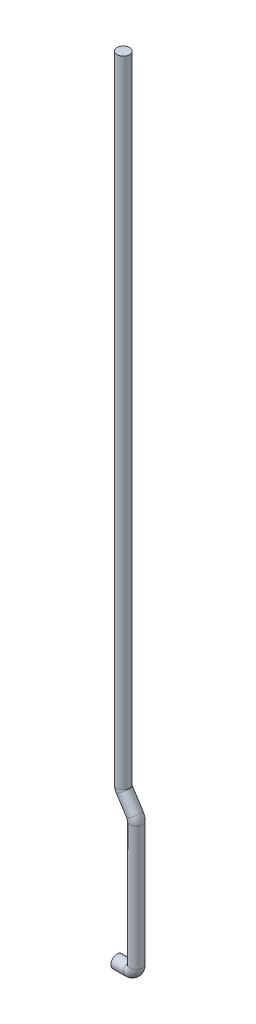
ISO-10303-21;
HEADER;
FILE_DESCRIPTION(('STEP AP214'),'2;1');
FILE_NAME('part.step','',(''),(''),'','','');
FILE_SCHEMA(('AUTOMOTIVE_DESIGN { 1 0 10303 214 1 1 1 1 }'));
ENDSEC;
DATA;
#1=APPLICATION_CONTEXT('core data for automotive mechanical design processes');
#2=APPLICATION_PROTOCOL_DEFINITION('international standard','automotive_design',2000,#1);
#3=PRODUCT_CONTEXT('',#1,'mechanical');
#4=PRODUCT('Part','Part','',(#3));
#5=PRODUCT_RELATED_PRODUCT_CATEGORY('part','',(#4));
#6=PRODUCT_DEFINITION_FORMATION('','',#4);
#7=PRODUCT_DEFINITION_CONTEXT('part definition',#1,'design');
#8=PRODUCT_DEFINITION('design','',#6,#7);
#9=PRODUCT_DEFINITION_SHAPE('','',#8);
#10=(LENGTH_UNIT() NAMED_UNIT(*) SI_UNIT(.MILLI.,.METRE.));
#11=(NAMED_UNIT(*) PLANE_ANGLE_UNIT() SI_UNIT($,.RADIAN.));
#12=(NAMED_UNIT(*) SI_UNIT($,.STERADIAN.) SOLID_ANGLE_UNIT());
#13=UNCERTAINTY_MEASURE_WITH_UNIT(LENGTH_MEASURE(1.E-05),#10,'distance_accuracy_value','');
#14=(GEOMETRIC_REPRESENTATION_CONTEXT(3) GLOBAL_UNCERTAINTY_ASSIGNED_CONTEXT((#13)) GLOBAL_UNIT_ASSIGNED_CONTEXT((#10,
#11,#12)) REPRESENTATION_CONTEXT('',''));
#15=CARTESIAN_POINT('',(0.,0.,0.));
#16=DIRECTION('',(0.,0.,1.));
#17=DIRECTION('',(1.,0.,0.));
#18=AXIS2_PLACEMENT_3D('',#15,#16,#17);
#19=CARTESIAN_POINT('',(3.99681423893343,508.128789654049,0.));
#20=DIRECTION('',(0.,1.,0.));
#21=DIRECTION('',(0.,0.,-1.));
#22=AXIS2_PLACEMENT_3D('',#19,#20,#21);
#23=PLANE('',#22);
#24=CARTESIAN_POINT('',(3.99681423893343,508.128789654049,0.));
#25=DIRECTION('',(0.,1.,0.));
#26=DIRECTION('',(0.,0.,-1.));
#27=AXIS2_PLACEMENT_3D('',#24,#25,#26);
#28=CIRCLE('',#27,4.);
#29=CARTESIAN_POINT('',(3.99681423893343,508.128789654049,-4.));
#30=VERTEX_POINT('',#29);
#31=EDGE_CURVE('E72',#30,#30,#28,.T.);
#32=ORIENTED_EDGE('',*,*,#31,.T.);
#33=EDGE_LOOP('',(#32));
#34=FACE_BOUND('',#33,.T.);
#35=ADVANCED_FACE('F37',(#34),#23,.T.);
#36=CARTESIAN_POINT('',(0.,0.,0.));
#37=DIRECTION('',(1.,0.,0.));
#38=DIRECTION('',(0.,0.,-1.));
#39=AXIS2_PLACEMENT_3D('',#36,#37,#38);
#40=PLANE('',#39);
#41=CARTESIAN_POINT('',(0.,0.,0.));
#42=DIRECTION('',(1.,0.,0.));
#43=DIRECTION('',(0.,0.,-1.));
#44=AXIS2_PLACEMENT_3D('',#41,#42,#43);
#45=CIRCLE('',#44,4.);
#46=CARTESIAN_POINT('',(0.,0.,-4.));
#47=VERTEX_POINT('',#46);
#48=EDGE_CURVE('E10',#47,#47,#45,.T.);
#49=ORIENTED_EDGE('',*,*,#48,.F.);
#50=EDGE_LOOP('',(#49));
#51=FACE_BOUND('',#50,.T.);
#52=ADVANCED_FACE('F81',(#51),#40,.F.);
#53=CARTESIAN_POINT('',(3.99681423893343,508.128789654049,0.));
#54=DIRECTION('',(0.,-1.,0.));
#55=DIRECTION('',(1.,0.,0.));
#56=AXIS2_PLACEMENT_3D('',#53,#54,#55);
#57=CYLINDRICAL_SURFACE('',#56,4.);
#58=CARTESIAN_POINT('',(3.99681423893348,100.083578157797,0.));
#59=DIRECTION('',(0.,1.,0.));
#60=DIRECTION('',(0.,0.,-1.));
#61=AXIS2_PLACEMENT_3D('',#58,#59,#60);
#62=CIRCLE('',#61,4.);
#63=CARTESIAN_POINT('',(-0.00318576106651813,100.083578157797,0.));
#64=VERTEX_POINT('',#63);
#65=EDGE_CURVE('E68',#64,#64,#62,.T.);
#66=ORIENTED_EDGE('',*,*,#65,.T.);
#67=EDGE_LOOP('',(#66));
#68=FACE_BOUND('',#67,.T.);
#69=ORIENTED_EDGE('',*,*,#31,.F.);
#70=EDGE_LOOP('',(#69));
#71=FACE_BOUND('',#70,.T.);
#72=ADVANCED_FACE('F78',(#68,#71),#57,.T.);
#73=CARTESIAN_POINT('',(8.34733367893348,100.083578157797,0.));
#74=DIRECTION('',(0.,0.,1.));
#75=DIRECTION('',(1.,0.,0.));
#76=AXIS2_PLACEMENT_3D('',#73,#74,#75);
#77=TOROIDAL_SURFACE('',#76,4.35051944,4.);
#78=CARTESIAN_POINT('',(4.68774241127974,97.7310452352796,0.));
#79=DIRECTION('',(-0.540747594617773,0.841184901739857,0.));
#80=DIRECTION('',(0.,0.,-1.));
#81=AXIS2_PLACEMENT_3D('',#78,#79,#80);
#82=CIRCLE('',#81,4.);
#83=CARTESIAN_POINT('',(1.32300280432031,95.5680548568085,0.));
#84=VERTEX_POINT('',#83);
#85=EDGE_CURVE('E64',#84,#84,#82,.T.);
#86=CARTESIAN_POINT('',(8.34733367893348,100.083578157797,0.));
#87=DIRECTION('',(0.,0.,1.));
#88=DIRECTION('',(1.,0.,0.));
#89=AXIS2_PLACEMENT_3D('',#86,#87,#88);
#90=CIRCLE('',#89,8.35051944);
#91=EDGE_CURVE('',#64,#84,#90,.T.);
#92=ORIENTED_EDGE('',*,*,#65,.F.);
#93=ORIENTED_EDGE('',*,*,#85,.T.);
#94=ORIENTED_EDGE('',*,*,#91,.T.);
#95=ORIENTED_EDGE('',*,*,#91,.F.);
#96=EDGE_LOOP('',(#92,#94,#93,#95));
#97=FACE_BOUND('',#96,.T.);
#98=ADVANCED_FACE('F80',(#97),#77,.T.);
#99=CARTESIAN_POINT('',(4.68774241127974,97.7310452352796,0.));
#100=DIRECTION('',(0.540747594617773,-0.841184901739857,0.));
#101=DIRECTION('',(0.841184901739857,0.540747594617773,0.));
#102=AXIS2_PLACEMENT_3D('',#99,#100,#101);
#103=CYLINDRICAL_SURFACE('',#102,4.);
#104=CARTESIAN_POINT('',(11.3883564338094,87.3075955440749,0.));
#105=DIRECTION('',(-0.540747594617773,0.841184901739857,0.));
#106=DIRECTION('',(0.,0.,-1.));
#107=AXIS2_PLACEMENT_3D('',#104,#105,#106);
#108=CIRCLE('',#107,4.);
#109=CARTESIAN_POINT('',(14.7530960407688,89.470585922546,0.));
#110=VERTEX_POINT('',#109);
#111=EDGE_CURVE('E60',#110,#110,#108,.T.);
#112=ORIENTED_EDGE('',*,*,#111,.T.);
#113=EDGE_LOOP('',(#112));
#114=FACE_BOUND('',#113,.T.);
#115=ORIENTED_EDGE('',*,*,#85,.F.);
#116=EDGE_LOOP('',(#115));
#117=FACE_BOUND('',#116,.T.);
#118=ADVANCED_FACE('F88',(#114,#117),#103,.T.);
#119=CARTESIAN_POINT('',(6.29213446549112,84.0315384425905,0.));
#120=DIRECTION('',(0.,0.,-1.));
#121=DIRECTION('',(-1.,0.,0.));
#122=AXIS2_PLACEMENT_3D('',#119,#120,#121);
#123=TOROIDAL_SURFACE('',#122,6.05838497312246,4.);
#124=CARTESIAN_POINT('',(12.3505194386136,84.0315384425905,0.));
#125=DIRECTION('',(0.,1.,0.));
#126=DIRECTION('',(0.,0.,-1.));
#127=AXIS2_PLACEMENT_3D('',#124,#125,#126);
#128=CIRCLE('',#127,4.);
#129=CARTESIAN_POINT('',(16.3505194386136,84.0315384425905,0.));
#130=VERTEX_POINT('',#129);
#131=EDGE_CURVE('E54',#130,#130,#128,.T.);
#132=CARTESIAN_POINT('',(6.29213446549112,84.0315384425905,0.));
#133=DIRECTION('',(0.,0.,-1.));
#134=DIRECTION('',(-1.,0.,0.));
#135=AXIS2_PLACEMENT_3D('',#132,#133,#134);
#136=CIRCLE('',#135,10.0583849731225);
#137=EDGE_CURVE('',#110,#130,#136,.T.);
#138=ORIENTED_EDGE('',*,*,#111,.F.);
#139=ORIENTED_EDGE('',*,*,#131,.T.);
#140=ORIENTED_EDGE('',*,*,#137,.T.);
#141=ORIENTED_EDGE('',*,*,#137,.F.);
#142=EDGE_LOOP('',(#138,#140,#139,#141));
#143=FACE_BOUND('',#142,.T.);
#144=ADVANCED_FACE('F105',(#143),#123,.T.);
#145=CARTESIAN_POINT('',(12.3505194386136,84.0315384425905,0.));
#146=DIRECTION('',(0.,-1.,0.));
#147=DIRECTION('',(1.,0.,0.));
#148=AXIS2_PLACEMENT_3D('',#145,#146,#147);
#149=CYLINDRICAL_SURFACE('',#148,4.);
#150=CARTESIAN_POINT('',(12.3505194386136,4.35051943861358,0.));
#151=DIRECTION('',(0.,1.,0.));
#152=DIRECTION('',(0.,0.,-1.));
#153=AXIS2_PLACEMENT_3D('',#150,#151,#152);
#154=CIRCLE('',#153,4.);
#155=CARTESIAN_POINT('',(16.3505194386136,4.35051943861358,0.));
#156=VERTEX_POINT('',#155);
#157=EDGE_CURVE('E49',#156,#156,#154,.T.);
#158=ORIENTED_EDGE('',*,*,#157,.T.);
#159=EDGE_LOOP('',(#158));
#160=FACE_BOUND('',#159,.T.);
#161=ORIENTED_EDGE('',*,*,#131,.F.);
#162=EDGE_LOOP('',(#161));
#163=FACE_BOUND('',#162,.T.);
#164=ADVANCED_FACE('F99',(#160,#163),#149,.T.);
#165=CARTESIAN_POINT('',(8.,4.35051943861358,0.));
#166=DIRECTION('',(0.,0.,-1.));
#167=DIRECTION('',(-1.,0.,0.));
#168=AXIS2_PLACEMENT_3D('',#165,#166,#167);
#169=TOROIDAL_SURFACE('',#168,4.35051943861358,4.);
#170=CARTESIAN_POINT('',(8.,0.,0.));
#171=DIRECTION('',(1.,0.,0.));
#172=DIRECTION('',(0.,0.,-1.));
#173=AXIS2_PLACEMENT_3D('',#170,#171,#172);
#174=CIRCLE('',#173,4.);
#175=CARTESIAN_POINT('',(8.,-4.,0.));
#176=VERTEX_POINT('',#175);
#177=EDGE_CURVE('E44',#176,#176,#174,.T.);
#178=CARTESIAN_POINT('',(8.,4.35051943861358,0.));
#179=DIRECTION('',(0.,0.,-1.));
#180=DIRECTION('',(-1.,0.,0.));
#181=AXIS2_PLACEMENT_3D('',#178,#179,#180);
#182=CIRCLE('',#181,8.35051943861358);
#183=EDGE_CURVE('',#156,#176,#182,.T.);
#184=ORIENTED_EDGE('',*,*,#157,.F.);
#185=ORIENTED_EDGE('',*,*,#177,.T.);
#186=ORIENTED_EDGE('',*,*,#183,.T.);
#187=ORIENTED_EDGE('',*,*,#183,.F.);
#188=EDGE_LOOP('',(#184,#186,#185,#187));
#189=FACE_BOUND('',#188,.T.);
#190=ADVANCED_FACE('F94',(#189),#169,.T.);
#191=CARTESIAN_POINT('',(8.,0.,0.));
#192=DIRECTION('',(-1.,0.,0.));
#193=DIRECTION('',(0.,0.,1.));
#194=AXIS2_PLACEMENT_3D('',#191,#192,#193);
#195=CYLINDRICAL_SURFACE('',#194,4.);
#196=ORIENTED_EDGE('',*,*,#48,.T.);
#197=EDGE_LOOP('',(#196));
#198=FACE_BOUND('',#197,.T.);
#199=ORIENTED_EDGE('',*,*,#177,.F.);
#200=EDGE_LOOP('',(#199));
#201=FACE_BOUND('',#200,.T.);
#202=ADVANCED_FACE('F92',(#198,#201),#195,.T.);
#203=CLOSED_SHELL('',(#35,#52,#72,#98,#118,#144,#164,#190,#202));
#204=MANIFOLD_SOLID_BREP('B2',#203);
#205=ADVANCED_BREP_SHAPE_REPRESENTATION('',(#18,#204),#14);
#206=SHAPE_DEFINITION_REPRESENTATION(#9,#205);
ENDSEC;
END-ISO-10303-21;
